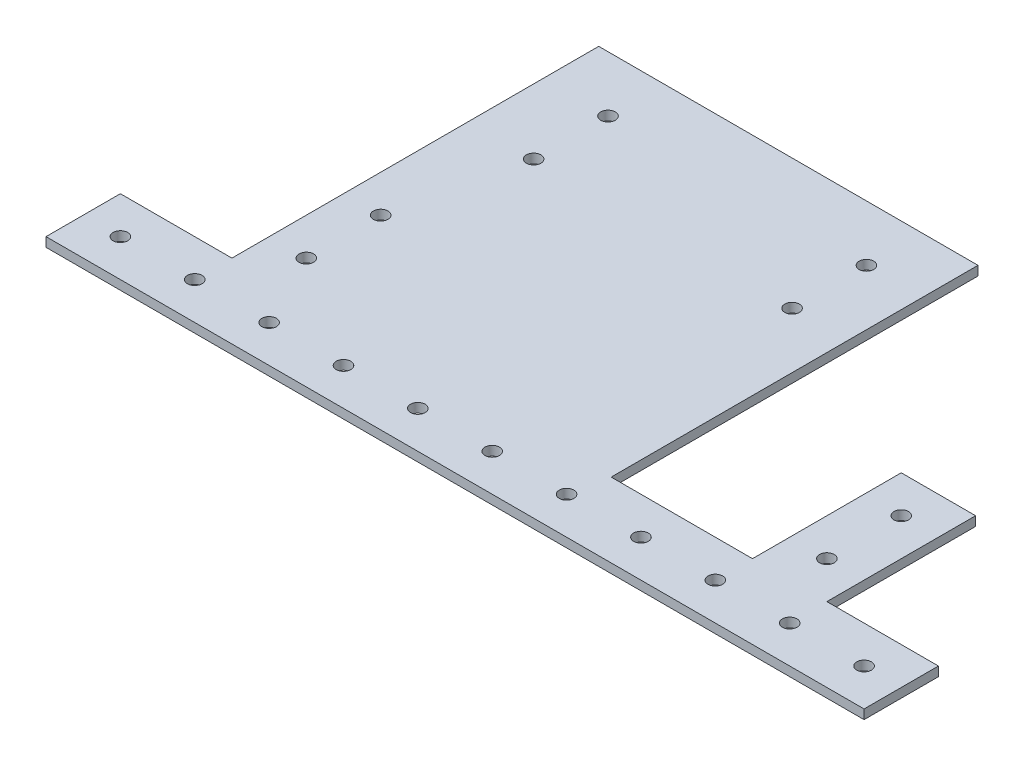
ISO-10303-21;
HEADER;
FILE_DESCRIPTION(('STEP AP214'),'2;1');
FILE_NAME('part.step','',(''),(''),'','','');
FILE_SCHEMA(('AUTOMOTIVE_DESIGN { 1 0 10303 214 1 1 1 1 }'));
ENDSEC;
DATA;
#1=APPLICATION_CONTEXT('core data for automotive mechanical design processes');
#2=APPLICATION_PROTOCOL_DEFINITION('international standard','automotive_design',2000,#1);
#3=PRODUCT_CONTEXT('',#1,'mechanical');
#4=PRODUCT('Part','Part','',(#3));
#5=PRODUCT_RELATED_PRODUCT_CATEGORY('part','',(#4));
#6=PRODUCT_DEFINITION_FORMATION('','',#4);
#7=PRODUCT_DEFINITION_CONTEXT('part definition',#1,'design');
#8=PRODUCT_DEFINITION('design','',#6,#7);
#9=PRODUCT_DEFINITION_SHAPE('','',#8);
#10=(LENGTH_UNIT() NAMED_UNIT(*) SI_UNIT(.MILLI.,.METRE.));
#11=(NAMED_UNIT(*) PLANE_ANGLE_UNIT() SI_UNIT($,.RADIAN.));
#12=(NAMED_UNIT(*) SI_UNIT($,.STERADIAN.) SOLID_ANGLE_UNIT());
#13=UNCERTAINTY_MEASURE_WITH_UNIT(LENGTH_MEASURE(1.E-05),#10,'distance_accuracy_value','');
#14=(GEOMETRIC_REPRESENTATION_CONTEXT(3) GLOBAL_UNCERTAINTY_ASSIGNED_CONTEXT((#13)) GLOBAL_UNIT_ASSIGNED_CONTEXT((#10,
#11,#12)) REPRESENTATION_CONTEXT('',''));
#15=CARTESIAN_POINT('',(0.,0.,0.));
#16=DIRECTION('',(0.,0.,1.));
#17=DIRECTION('',(1.,0.,0.));
#18=AXIS2_PLACEMENT_3D('',#15,#16,#17);
#19=CARTESIAN_POINT('',(0.,3.175,0.));
#20=DIRECTION('',(0.,-1.,0.));
#21=DIRECTION('',(0.,0.,-1.));
#22=AXIS2_PLACEMENT_3D('',#19,#20,#21);
#23=PLANE('',#22);
#24=DIRECTION('',(0.,0.,1.));
#25=VECTOR('',#24,1.);
#26=CARTESIAN_POINT('',(-101.6,3.175,-25.4));
#27=LINE('',#26,#25);
#28=CARTESIAN_POINT('',(-101.6,3.175,-150.6728));
#29=VERTEX_POINT('',#28);
#30=CARTESIAN_POINT('',(-101.6,3.175,-25.4));
#31=VERTEX_POINT('',#30);
#32=EDGE_CURVE('E178',#29,#31,#27,.T.);
#33=ORIENTED_EDGE('',*,*,#32,.T.);
#34=DIRECTION('',(-1.,0.,0.));
#35=VECTOR('',#34,1.);
#36=CARTESIAN_POINT('',(-139.7,3.175,-25.4));
#37=LINE('',#36,#35);
#38=CARTESIAN_POINT('',(-139.7,3.175,-25.4));
#39=VERTEX_POINT('',#38);
#40=EDGE_CURVE('E106',#31,#39,#37,.T.);
#41=ORIENTED_EDGE('',*,*,#40,.T.);
#42=DIRECTION('',(0.,0.,1.));
#43=VECTOR('',#42,1.);
#44=CARTESIAN_POINT('',(-139.7,3.175,0.));
#45=LINE('',#44,#43);
#46=CARTESIAN_POINT('',(-139.7,3.175,0.));
#47=VERTEX_POINT('',#46);
#48=EDGE_CURVE('E205',#39,#47,#45,.T.);
#49=ORIENTED_EDGE('',*,*,#48,.T.);
#50=DIRECTION('',(1.,0.,0.));
#51=VECTOR('',#50,1.);
#52=CARTESIAN_POINT('',(139.7,3.175,0.));
#53=LINE('',#52,#51);
#54=CARTESIAN_POINT('',(139.7,3.175,0.));
#55=VERTEX_POINT('',#54);
#56=EDGE_CURVE('E224',#47,#55,#53,.T.);
#57=ORIENTED_EDGE('',*,*,#56,.T.);
#58=DIRECTION('',(0.,0.,-1.));
#59=VECTOR('',#58,1.);
#60=CARTESIAN_POINT('',(139.7,3.175,0.));
#61=LINE('',#60,#59);
#62=CARTESIAN_POINT('',(139.7,3.175,-25.4000000000001));
#63=VERTEX_POINT('',#62);
#64=EDGE_CURVE('E221',#55,#63,#61,.T.);
#65=ORIENTED_EDGE('',*,*,#64,.T.);
#66=DIRECTION('',(-1.,0.,0.));
#67=VECTOR('',#66,1.);
#68=CARTESIAN_POINT('',(139.7,3.175,-25.4000000000001));
#69=LINE('',#68,#67);
#70=CARTESIAN_POINT('',(101.6,3.175,-25.4));
#71=VERTEX_POINT('',#70);
#72=EDGE_CURVE('E223',#63,#71,#69,.T.);
#73=ORIENTED_EDGE('',*,*,#72,.T.);
#74=DIRECTION('',(0.,0.,-1.));
#75=VECTOR('',#74,1.);
#76=CARTESIAN_POINT('',(101.6,3.175,-25.4));
#77=LINE('',#76,#75);
#78=CARTESIAN_POINT('',(101.6,3.175,-76.2));
#79=VERTEX_POINT('',#78);
#80=EDGE_CURVE('E226',#71,#79,#77,.T.);
#81=ORIENTED_EDGE('',*,*,#80,.T.);
#82=DIRECTION('',(-1.,0.,0.));
#83=VECTOR('',#82,1.);
#84=CARTESIAN_POINT('',(76.1999999999999,3.175,-76.2));
#85=LINE('',#84,#83);
#86=CARTESIAN_POINT('',(76.1999999999999,3.175,-76.2));
#87=VERTEX_POINT('',#86);
#88=EDGE_CURVE('E232',#79,#87,#85,.T.);
#89=ORIENTED_EDGE('',*,*,#88,.T.);
#90=DIRECTION('',(0.,0.,1.));
#91=VECTOR('',#90,1.);
#92=CARTESIAN_POINT('',(76.1999999999999,3.175,-25.4));
#93=LINE('',#92,#91);
#94=CARTESIAN_POINT('',(76.1999999999999,3.175,-25.4));
#95=VERTEX_POINT('',#94);
#96=EDGE_CURVE('E137',#87,#95,#93,.T.);
#97=ORIENTED_EDGE('',*,*,#96,.T.);
#98=DIRECTION('',(-1.,0.,0.));
#99=VECTOR('',#98,1.);
#100=CARTESIAN_POINT('',(27.9400000000001,3.175,-25.3999999999999));
#101=LINE('',#100,#99);
#102=CARTESIAN_POINT('',(27.9400000000001,3.175,-25.3999999999999));
#103=VERTEX_POINT('',#102);
#104=EDGE_CURVE('E131',#95,#103,#101,.T.);
#105=ORIENTED_EDGE('',*,*,#104,.T.);
#106=DIRECTION('',(0.,0.,-1.));
#107=VECTOR('',#106,1.);
#108=CARTESIAN_POINT('',(27.9399999999999,3.175,-150.6728));
#109=LINE('',#108,#107);
#110=CARTESIAN_POINT('',(27.9399999999999,3.175,-150.6728));
#111=VERTEX_POINT('',#110);
#112=EDGE_CURVE('E135',#103,#111,#109,.T.);
#113=ORIENTED_EDGE('',*,*,#112,.T.);
#114=DIRECTION('',(-1.,0.,0.));
#115=VECTOR('',#114,1.);
#116=CARTESIAN_POINT('',(-101.6,3.175,-150.6728));
#117=LINE('',#116,#115);
#118=EDGE_CURVE('E51',#111,#29,#117,.T.);
#119=ORIENTED_EDGE('',*,*,#118,.T.);
#120=EDGE_LOOP('',(#33,#41,#49,#57,#65,#73,#81,#89,#97,#105,#113,#119));
#121=FACE_BOUND('',#120,.T.);
#122=CARTESIAN_POINT('',(-127.,3.175,-12.7));
#123=DIRECTION('',(0.,1.,0.));
#124=DIRECTION('',(0.,0.,1.));
#125=AXIS2_PLACEMENT_3D('',#122,#123,#124);
#126=CIRCLE('',#125,2.4892);
#127=CARTESIAN_POINT('',(-127.,3.175,-10.2108));
#128=VERTEX_POINT('',#127);
#129=EDGE_CURVE('E159',#128,#128,#126,.T.);
#130=ORIENTED_EDGE('',*,*,#129,.F.);
#131=EDGE_LOOP('',(#130));
#132=FACE_BOUND('',#131,.T.);
#133=CARTESIAN_POINT('',(-88.8999999999999,3.175,-38.1));
#134=DIRECTION('',(0.,1.,0.));
#135=DIRECTION('',(0.,0.,1.));
#136=AXIS2_PLACEMENT_3D('',#133,#134,#135);
#137=CIRCLE('',#136,2.4892);
#138=CARTESIAN_POINT('',(-88.8999999999999,3.175,-35.6108));
#139=VERTEX_POINT('',#138);
#140=EDGE_CURVE('E446',#139,#139,#137,.T.);
#141=ORIENTED_EDGE('',*,*,#140,.F.);
#142=EDGE_LOOP('',(#141));
#143=FACE_BOUND('',#142,.T.);
#144=CARTESIAN_POINT('',(-88.8999999999999,3.175,-63.5));
#145=DIRECTION('',(0.,1.,0.));
#146=DIRECTION('',(0.,0.,1.));
#147=AXIS2_PLACEMENT_3D('',#144,#145,#146);
#148=CIRCLE('',#147,2.4892);
#149=CARTESIAN_POINT('',(-88.8999999999999,3.175,-61.0108));
#150=VERTEX_POINT('',#149);
#151=EDGE_CURVE('E440',#150,#150,#148,.T.);
#152=ORIENTED_EDGE('',*,*,#151,.F.);
#153=EDGE_LOOP('',(#152));
#154=FACE_BOUND('',#153,.T.);
#155=CARTESIAN_POINT('',(-79.375,3.175,-131.6228));
#156=DIRECTION('',(0.,1.,0.));
#157=DIRECTION('',(0.,0.,1.));
#158=AXIS2_PLACEMENT_3D('',#155,#156,#157);
#159=CIRCLE('',#158,2.48920000000002);
#160=CARTESIAN_POINT('',(-79.375,3.175,-129.1336));
#161=VERTEX_POINT('',#160);
#162=EDGE_CURVE('E434',#161,#161,#159,.T.);
#163=ORIENTED_EDGE('',*,*,#162,.F.);
#164=EDGE_LOOP('',(#163));
#165=FACE_BOUND('',#164,.T.);
#166=CARTESIAN_POINT('',(-79.375,3.175,-106.2228));
#167=DIRECTION('',(0.,1.,0.));
#168=DIRECTION('',(0.,0.,1.));
#169=AXIS2_PLACEMENT_3D('',#166,#167,#168);
#170=CIRCLE('',#169,2.4892);
#171=CARTESIAN_POINT('',(-79.375,3.175,-103.7336));
#172=VERTEX_POINT('',#171);
#173=EDGE_CURVE('E428',#172,#172,#170,.T.);
#174=ORIENTED_EDGE('',*,*,#173,.F.);
#175=EDGE_LOOP('',(#174));
#176=FACE_BOUND('',#175,.T.);
#177=CARTESIAN_POINT('',(8.88999999999996,3.175,-106.2228));
#178=DIRECTION('',(0.,1.,0.));
#179=DIRECTION('',(0.,0.,1.));
#180=AXIS2_PLACEMENT_3D('',#177,#178,#179);
#181=CIRCLE('',#180,2.48919999999999);
#182=CARTESIAN_POINT('',(8.88999999999996,3.175,-103.7336));
#183=VERTEX_POINT('',#182);
#184=EDGE_CURVE('E422',#183,#183,#181,.T.);
#185=ORIENTED_EDGE('',*,*,#184,.F.);
#186=EDGE_LOOP('',(#185));
#187=FACE_BOUND('',#186,.T.);
#188=CARTESIAN_POINT('',(8.88999999999995,3.175,-131.6228));
#189=DIRECTION('',(0.,1.,0.));
#190=DIRECTION('',(0.,0.,1.));
#191=AXIS2_PLACEMENT_3D('',#188,#189,#190);
#192=CIRCLE('',#191,2.48920000000002);
#193=CARTESIAN_POINT('',(8.88999999999995,3.175,-129.1336));
#194=VERTEX_POINT('',#193);
#195=EDGE_CURVE('E416',#194,#194,#192,.T.);
#196=ORIENTED_EDGE('',*,*,#195,.F.);
#197=EDGE_LOOP('',(#196));
#198=FACE_BOUND('',#197,.T.);
#199=CARTESIAN_POINT('',(88.8999999999999,3.175,-63.5));
#200=DIRECTION('',(0.,1.,0.));
#201=DIRECTION('',(0.,0.,1.));
#202=AXIS2_PLACEMENT_3D('',#199,#200,#201);
#203=CIRCLE('',#202,2.48920000000002);
#204=CARTESIAN_POINT('',(88.8999999999999,3.175,-61.0108));
#205=VERTEX_POINT('',#204);
#206=EDGE_CURVE('E410',#205,#205,#203,.T.);
#207=ORIENTED_EDGE('',*,*,#206,.F.);
#208=EDGE_LOOP('',(#207));
#209=FACE_BOUND('',#208,.T.);
#210=CARTESIAN_POINT('',(88.8999999999999,3.175,-38.1));
#211=DIRECTION('',(0.,1.,0.));
#212=DIRECTION('',(0.,0.,1.));
#213=AXIS2_PLACEMENT_3D('',#210,#211,#212);
#214=CIRCLE('',#213,2.4892);
#215=CARTESIAN_POINT('',(88.8999999999999,3.175,-35.6108));
#216=VERTEX_POINT('',#215);
#217=EDGE_CURVE('E404',#216,#216,#214,.T.);
#218=ORIENTED_EDGE('',*,*,#217,.F.);
#219=EDGE_LOOP('',(#218));
#220=FACE_BOUND('',#219,.T.);
#221=CARTESIAN_POINT('',(-101.6,3.175,-12.7));
#222=DIRECTION('',(0.,1.,0.));
#223=DIRECTION('',(0.,0.,1.));
#224=AXIS2_PLACEMENT_3D('',#221,#222,#223);
#225=CIRCLE('',#224,2.4892);
#226=CARTESIAN_POINT('',(-101.6,3.175,-10.2108));
#227=VERTEX_POINT('',#226);
#228=EDGE_CURVE('E398',#227,#227,#225,.T.);
#229=ORIENTED_EDGE('',*,*,#228,.F.);
#230=EDGE_LOOP('',(#229));
#231=FACE_BOUND('',#230,.T.);
#232=CARTESIAN_POINT('',(-76.2,3.175,-12.7));
#233=DIRECTION('',(0.,1.,0.));
#234=DIRECTION('',(0.,0.,1.));
#235=AXIS2_PLACEMENT_3D('',#232,#233,#234);
#236=CIRCLE('',#235,2.4892);
#237=CARTESIAN_POINT('',(-76.2,3.175,-10.2108));
#238=VERTEX_POINT('',#237);
#239=EDGE_CURVE('E392',#238,#238,#236,.T.);
#240=ORIENTED_EDGE('',*,*,#239,.F.);
#241=EDGE_LOOP('',(#240));
#242=FACE_BOUND('',#241,.T.);
#243=CARTESIAN_POINT('',(-50.8,3.175,-12.7));
#244=DIRECTION('',(0.,1.,0.));
#245=DIRECTION('',(0.,0.,1.));
#246=AXIS2_PLACEMENT_3D('',#243,#244,#245);
#247=CIRCLE('',#246,2.4892);
#248=CARTESIAN_POINT('',(-50.8,3.175,-10.2108));
#249=VERTEX_POINT('',#248);
#250=EDGE_CURVE('E386',#249,#249,#247,.T.);
#251=ORIENTED_EDGE('',*,*,#250,.F.);
#252=EDGE_LOOP('',(#251));
#253=FACE_BOUND('',#252,.T.);
#254=CARTESIAN_POINT('',(-25.4,3.175,-12.7));
#255=DIRECTION('',(0.,1.,0.));
#256=DIRECTION('',(0.,0.,1.));
#257=AXIS2_PLACEMENT_3D('',#254,#255,#256);
#258=CIRCLE('',#257,2.4892);
#259=CARTESIAN_POINT('',(-25.4,3.175,-10.2108));
#260=VERTEX_POINT('',#259);
#261=EDGE_CURVE('E380',#260,#260,#258,.T.);
#262=ORIENTED_EDGE('',*,*,#261,.F.);
#263=EDGE_LOOP('',(#262));
#264=FACE_BOUND('',#263,.T.);
#265=CARTESIAN_POINT('',(0.,3.175,-12.7));
#266=DIRECTION('',(0.,1.,0.));
#267=DIRECTION('',(0.,0.,1.));
#268=AXIS2_PLACEMENT_3D('',#265,#266,#267);
#269=CIRCLE('',#268,2.4892);
#270=CARTESIAN_POINT('',(0.,3.175,-10.2108));
#271=VERTEX_POINT('',#270);
#272=EDGE_CURVE('E374',#271,#271,#269,.T.);
#273=ORIENTED_EDGE('',*,*,#272,.F.);
#274=EDGE_LOOP('',(#273));
#275=FACE_BOUND('',#274,.T.);
#276=CARTESIAN_POINT('',(25.4,3.175,-12.7));
#277=DIRECTION('',(0.,1.,0.));
#278=DIRECTION('',(0.,0.,1.));
#279=AXIS2_PLACEMENT_3D('',#276,#277,#278);
#280=CIRCLE('',#279,2.4892);
#281=CARTESIAN_POINT('',(25.4,3.175,-10.2108));
#282=VERTEX_POINT('',#281);
#283=EDGE_CURVE('E368',#282,#282,#280,.T.);
#284=ORIENTED_EDGE('',*,*,#283,.F.);
#285=EDGE_LOOP('',(#284));
#286=FACE_BOUND('',#285,.T.);
#287=CARTESIAN_POINT('',(50.8,3.175,-12.7));
#288=DIRECTION('',(0.,1.,0.));
#289=DIRECTION('',(0.,0.,1.));
#290=AXIS2_PLACEMENT_3D('',#287,#288,#289);
#291=CIRCLE('',#290,2.4892);
#292=CARTESIAN_POINT('',(50.8,3.175,-10.2108));
#293=VERTEX_POINT('',#292);
#294=EDGE_CURVE('E362',#293,#293,#291,.T.);
#295=ORIENTED_EDGE('',*,*,#294,.F.);
#296=EDGE_LOOP('',(#295));
#297=FACE_BOUND('',#296,.T.);
#298=CARTESIAN_POINT('',(76.2,3.175,-12.7));
#299=DIRECTION('',(0.,1.,0.));
#300=DIRECTION('',(0.,0.,1.));
#301=AXIS2_PLACEMENT_3D('',#298,#299,#300);
#302=CIRCLE('',#301,2.4892);
#303=CARTESIAN_POINT('',(76.2,3.175,-10.2108));
#304=VERTEX_POINT('',#303);
#305=EDGE_CURVE('E356',#304,#304,#302,.T.);
#306=ORIENTED_EDGE('',*,*,#305,.F.);
#307=EDGE_LOOP('',(#306));
#308=FACE_BOUND('',#307,.T.);
#309=CARTESIAN_POINT('',(101.6,3.175,-12.7));
#310=DIRECTION('',(0.,1.,0.));
#311=DIRECTION('',(0.,0.,1.));
#312=AXIS2_PLACEMENT_3D('',#309,#310,#311);
#313=CIRCLE('',#312,2.4892);
#314=CARTESIAN_POINT('',(101.6,3.175,-10.2108));
#315=VERTEX_POINT('',#314);
#316=EDGE_CURVE('E350',#315,#315,#313,.T.);
#317=ORIENTED_EDGE('',*,*,#316,.F.);
#318=EDGE_LOOP('',(#317));
#319=FACE_BOUND('',#318,.T.);
#320=CARTESIAN_POINT('',(127.,3.175,-12.7));
#321=DIRECTION('',(0.,1.,0.));
#322=DIRECTION('',(0.,0.,1.));
#323=AXIS2_PLACEMENT_3D('',#320,#321,#322);
#324=CIRCLE('',#323,2.4892);
#325=CARTESIAN_POINT('',(127.,3.175,-10.2108));
#326=VERTEX_POINT('',#325);
#327=EDGE_CURVE('E341',#326,#326,#324,.T.);
#328=ORIENTED_EDGE('',*,*,#327,.F.);
#329=EDGE_LOOP('',(#328));
#330=FACE_BOUND('',#329,.T.);
#331=ADVANCED_FACE('F34',(#121,#132,#143,#154,#165,#176,#187,#198,#209,#220,#231,#242,#253,#264,
#275,#286,#297,#308,#319,#330),#23,.F.);
#332=CARTESIAN_POINT('',(0.,0.,0.));
#333=DIRECTION('',(0.,-1.,0.));
#334=DIRECTION('',(0.,0.,-1.));
#335=AXIS2_PLACEMENT_3D('',#332,#333,#334);
#336=PLANE('',#335);
#337=CARTESIAN_POINT('',(101.6,0.,-12.7));
#338=DIRECTION('',(0.,1.,0.));
#339=DIRECTION('',(0.,0.,1.));
#340=AXIS2_PLACEMENT_3D('',#337,#338,#339);
#341=CIRCLE('',#340,2.4892);
#342=CARTESIAN_POINT('',(101.6,0.,-10.2108));
#343=VERTEX_POINT('',#342);
#344=EDGE_CURVE('E347',#343,#343,#341,.T.);
#345=ORIENTED_EDGE('',*,*,#344,.T.);
#346=EDGE_LOOP('',(#345));
#347=FACE_BOUND('',#346,.T.);
#348=CARTESIAN_POINT('',(50.8,0.,-12.7));
#349=DIRECTION('',(0.,1.,0.));
#350=DIRECTION('',(0.,0.,1.));
#351=AXIS2_PLACEMENT_3D('',#348,#349,#350);
#352=CIRCLE('',#351,2.4892);
#353=CARTESIAN_POINT('',(50.8,0.,-10.2108));
#354=VERTEX_POINT('',#353);
#355=EDGE_CURVE('E359',#354,#354,#352,.T.);
#356=ORIENTED_EDGE('',*,*,#355,.T.);
#357=EDGE_LOOP('',(#356));
#358=FACE_BOUND('',#357,.T.);
#359=CARTESIAN_POINT('',(0.,0.,-12.7));
#360=DIRECTION('',(0.,1.,0.));
#361=DIRECTION('',(0.,0.,1.));
#362=AXIS2_PLACEMENT_3D('',#359,#360,#361);
#363=CIRCLE('',#362,2.4892);
#364=CARTESIAN_POINT('',(0.,0.,-10.2108));
#365=VERTEX_POINT('',#364);
#366=EDGE_CURVE('E371',#365,#365,#363,.T.);
#367=ORIENTED_EDGE('',*,*,#366,.T.);
#368=EDGE_LOOP('',(#367));
#369=FACE_BOUND('',#368,.T.);
#370=CARTESIAN_POINT('',(-50.8,0.,-12.7));
#371=DIRECTION('',(0.,1.,0.));
#372=DIRECTION('',(0.,0.,1.));
#373=AXIS2_PLACEMENT_3D('',#370,#371,#372);
#374=CIRCLE('',#373,2.4892);
#375=CARTESIAN_POINT('',(-50.8,0.,-10.2108));
#376=VERTEX_POINT('',#375);
#377=EDGE_CURVE('E383',#376,#376,#374,.T.);
#378=ORIENTED_EDGE('',*,*,#377,.T.);
#379=EDGE_LOOP('',(#378));
#380=FACE_BOUND('',#379,.T.);
#381=CARTESIAN_POINT('',(-101.6,0.,-12.7));
#382=DIRECTION('',(0.,1.,0.));
#383=DIRECTION('',(0.,0.,1.));
#384=AXIS2_PLACEMENT_3D('',#381,#382,#383);
#385=CIRCLE('',#384,2.4892);
#386=CARTESIAN_POINT('',(-101.6,0.,-10.2108));
#387=VERTEX_POINT('',#386);
#388=EDGE_CURVE('E395',#387,#387,#385,.T.);
#389=ORIENTED_EDGE('',*,*,#388,.T.);
#390=EDGE_LOOP('',(#389));
#391=FACE_BOUND('',#390,.T.);
#392=CARTESIAN_POINT('',(88.8999999999999,0.,-63.5));
#393=DIRECTION('',(0.,1.,0.));
#394=DIRECTION('',(0.,0.,1.));
#395=AXIS2_PLACEMENT_3D('',#392,#393,#394);
#396=CIRCLE('',#395,2.48920000000002);
#397=CARTESIAN_POINT('',(88.8999999999999,0.,-61.0108));
#398=VERTEX_POINT('',#397);
#399=EDGE_CURVE('E407',#398,#398,#396,.T.);
#400=ORIENTED_EDGE('',*,*,#399,.T.);
#401=EDGE_LOOP('',(#400));
#402=FACE_BOUND('',#401,.T.);
#403=CARTESIAN_POINT('',(8.88999999999996,0.,-106.2228));
#404=DIRECTION('',(0.,1.,0.));
#405=DIRECTION('',(0.,0.,1.));
#406=AXIS2_PLACEMENT_3D('',#403,#404,#405);
#407=CIRCLE('',#406,2.48919999999999);
#408=CARTESIAN_POINT('',(8.88999999999996,0.,-103.7336));
#409=VERTEX_POINT('',#408);
#410=EDGE_CURVE('E419',#409,#409,#407,.T.);
#411=ORIENTED_EDGE('',*,*,#410,.T.);
#412=EDGE_LOOP('',(#411));
#413=FACE_BOUND('',#412,.T.);
#414=CARTESIAN_POINT('',(-79.375,0.,-131.6228));
#415=DIRECTION('',(0.,1.,0.));
#416=DIRECTION('',(0.,0.,1.));
#417=AXIS2_PLACEMENT_3D('',#414,#415,#416);
#418=CIRCLE('',#417,2.48920000000002);
#419=CARTESIAN_POINT('',(-79.375,0.,-129.1336));
#420=VERTEX_POINT('',#419);
#421=EDGE_CURVE('E431',#420,#420,#418,.T.);
#422=ORIENTED_EDGE('',*,*,#421,.T.);
#423=EDGE_LOOP('',(#422));
#424=FACE_BOUND('',#423,.T.);
#425=CARTESIAN_POINT('',(-88.8999999999999,0.,-38.1));
#426=DIRECTION('',(0.,1.,0.));
#427=DIRECTION('',(0.,0.,1.));
#428=AXIS2_PLACEMENT_3D('',#425,#426,#427);
#429=CIRCLE('',#428,2.4892);
#430=CARTESIAN_POINT('',(-88.8999999999999,0.,-35.6108));
#431=VERTEX_POINT('',#430);
#432=EDGE_CURVE('E443',#431,#431,#429,.T.);
#433=ORIENTED_EDGE('',*,*,#432,.T.);
#434=EDGE_LOOP('',(#433));
#435=FACE_BOUND('',#434,.T.);
#436=DIRECTION('',(0.,0.,1.));
#437=VECTOR('',#436,1.);
#438=CARTESIAN_POINT('',(-101.6,0.,-25.4));
#439=LINE('',#438,#437);
#440=CARTESIAN_POINT('',(-101.6,0.,-150.6728));
#441=VERTEX_POINT('',#440);
#442=CARTESIAN_POINT('',(-101.6,0.,-25.4));
#443=VERTEX_POINT('',#442);
#444=EDGE_CURVE('E155',#441,#443,#439,.T.);
#445=ORIENTED_EDGE('',*,*,#444,.F.);
#446=DIRECTION('',(-1.,0.,0.));
#447=VECTOR('',#446,1.);
#448=CARTESIAN_POINT('',(-101.6,0.,-150.6728));
#449=LINE('',#448,#447);
#450=CARTESIAN_POINT('',(27.9399999999999,0.,-150.6728));
#451=VERTEX_POINT('',#450);
#452=EDGE_CURVE('E98',#451,#441,#449,.T.);
#453=ORIENTED_EDGE('',*,*,#452,.F.);
#454=DIRECTION('',(0.,0.,-1.));
#455=VECTOR('',#454,1.);
#456=CARTESIAN_POINT('',(27.9399999999999,0.,-150.6728));
#457=LINE('',#456,#455);
#458=CARTESIAN_POINT('',(27.9400000000001,0.,-25.3999999999999));
#459=VERTEX_POINT('',#458);
#460=EDGE_CURVE('E92',#459,#451,#457,.T.);
#461=ORIENTED_EDGE('',*,*,#460,.F.);
#462=DIRECTION('',(-1.,0.,0.));
#463=VECTOR('',#462,1.);
#464=CARTESIAN_POINT('',(27.9400000000001,0.,-25.3999999999999));
#465=LINE('',#464,#463);
#466=CARTESIAN_POINT('',(76.1999999999999,0.,-25.4));
#467=VERTEX_POINT('',#466);
#468=EDGE_CURVE('E145',#467,#459,#465,.T.);
#469=ORIENTED_EDGE('',*,*,#468,.F.);
#470=DIRECTION('',(0.,0.,1.));
#471=VECTOR('',#470,1.);
#472=CARTESIAN_POINT('',(76.1999999999999,0.,-25.4));
#473=LINE('',#472,#471);
#474=CARTESIAN_POINT('',(76.1999999999999,0.,-76.2));
#475=VERTEX_POINT('',#474);
#476=EDGE_CURVE('E173',#475,#467,#473,.T.);
#477=ORIENTED_EDGE('',*,*,#476,.F.);
#478=DIRECTION('',(-1.,0.,0.));
#479=VECTOR('',#478,1.);
#480=CARTESIAN_POINT('',(76.1999999999999,0.,-76.2));
#481=LINE('',#480,#479);
#482=CARTESIAN_POINT('',(101.6,0.,-76.2));
#483=VERTEX_POINT('',#482);
#484=EDGE_CURVE('E171',#483,#475,#481,.T.);
#485=ORIENTED_EDGE('',*,*,#484,.F.);
#486=DIRECTION('',(0.,0.,-1.));
#487=VECTOR('',#486,1.);
#488=CARTESIAN_POINT('',(101.6,0.,-25.4));
#489=LINE('',#488,#487);
#490=CARTESIAN_POINT('',(101.6,0.,-25.4));
#491=VERTEX_POINT('',#490);
#492=EDGE_CURVE('E169',#491,#483,#489,.T.);
#493=ORIENTED_EDGE('',*,*,#492,.F.);
#494=DIRECTION('',(-1.,0.,0.));
#495=VECTOR('',#494,1.);
#496=CARTESIAN_POINT('',(139.7,0.,-25.4000000000001));
#497=LINE('',#496,#495);
#498=CARTESIAN_POINT('',(139.7,0.,-25.4000000000001));
#499=VERTEX_POINT('',#498);
#500=EDGE_CURVE('E167',#499,#491,#497,.T.);
#501=ORIENTED_EDGE('',*,*,#500,.F.);
#502=DIRECTION('',(0.,0.,-1.));
#503=VECTOR('',#502,1.);
#504=CARTESIAN_POINT('',(139.7,0.,0.));
#505=LINE('',#504,#503);
#506=CARTESIAN_POINT('',(139.7,0.,0.));
#507=VERTEX_POINT('',#506);
#508=EDGE_CURVE('E165',#507,#499,#505,.T.);
#509=ORIENTED_EDGE('',*,*,#508,.F.);
#510=DIRECTION('',(1.,0.,0.));
#511=VECTOR('',#510,1.);
#512=CARTESIAN_POINT('',(139.7,0.,0.));
#513=LINE('',#512,#511);
#514=CARTESIAN_POINT('',(-139.7,0.,0.));
#515=VERTEX_POINT('',#514);
#516=EDGE_CURVE('E163',#515,#507,#513,.T.);
#517=ORIENTED_EDGE('',*,*,#516,.F.);
#518=DIRECTION('',(0.,0.,1.));
#519=VECTOR('',#518,1.);
#520=CARTESIAN_POINT('',(-139.7,0.,0.));
#521=LINE('',#520,#519);
#522=CARTESIAN_POINT('',(-139.7,0.,-25.4));
#523=VERTEX_POINT('',#522);
#524=EDGE_CURVE('E161',#523,#515,#521,.T.);
#525=ORIENTED_EDGE('',*,*,#524,.F.);
#526=DIRECTION('',(-1.,0.,0.));
#527=VECTOR('',#526,1.);
#528=CARTESIAN_POINT('',(-139.7,0.,-25.4));
#529=LINE('',#528,#527);
#530=EDGE_CURVE('E158',#443,#523,#529,.T.);
#531=ORIENTED_EDGE('',*,*,#530,.F.);
#532=EDGE_LOOP('',(#445,#453,#461,#469,#477,#485,#493,#501,#509,#517,#525,#531));
#533=FACE_BOUND('',#532,.T.);
#534=CARTESIAN_POINT('',(-127.,0.,-12.7));
#535=DIRECTION('',(0.,1.,0.));
#536=DIRECTION('',(0.,0.,1.));
#537=AXIS2_PLACEMENT_3D('',#534,#535,#536);
#538=CIRCLE('',#537,2.4892);
#539=CARTESIAN_POINT('',(-127.,0.,-10.2108));
#540=VERTEX_POINT('',#539);
#541=EDGE_CURVE('E449',#540,#540,#538,.T.);
#542=ORIENTED_EDGE('',*,*,#541,.T.);
#543=EDGE_LOOP('',(#542));
#544=FACE_BOUND('',#543,.T.);
#545=CARTESIAN_POINT('',(-88.8999999999999,0.,-63.5));
#546=DIRECTION('',(0.,1.,0.));
#547=DIRECTION('',(0.,0.,1.));
#548=AXIS2_PLACEMENT_3D('',#545,#546,#547);
#549=CIRCLE('',#548,2.4892);
#550=CARTESIAN_POINT('',(-88.8999999999999,0.,-61.0108));
#551=VERTEX_POINT('',#550);
#552=EDGE_CURVE('E437',#551,#551,#549,.T.);
#553=ORIENTED_EDGE('',*,*,#552,.T.);
#554=EDGE_LOOP('',(#553));
#555=FACE_BOUND('',#554,.T.);
#556=CARTESIAN_POINT('',(-79.375,0.,-106.2228));
#557=DIRECTION('',(0.,1.,0.));
#558=DIRECTION('',(0.,0.,1.));
#559=AXIS2_PLACEMENT_3D('',#556,#557,#558);
#560=CIRCLE('',#559,2.4892);
#561=CARTESIAN_POINT('',(-79.375,0.,-103.7336));
#562=VERTEX_POINT('',#561);
#563=EDGE_CURVE('E425',#562,#562,#560,.T.);
#564=ORIENTED_EDGE('',*,*,#563,.T.);
#565=EDGE_LOOP('',(#564));
#566=FACE_BOUND('',#565,.T.);
#567=CARTESIAN_POINT('',(8.88999999999995,0.,-131.6228));
#568=DIRECTION('',(0.,1.,0.));
#569=DIRECTION('',(0.,0.,1.));
#570=AXIS2_PLACEMENT_3D('',#567,#568,#569);
#571=CIRCLE('',#570,2.48920000000002);
#572=CARTESIAN_POINT('',(8.88999999999995,0.,-129.1336));
#573=VERTEX_POINT('',#572);
#574=EDGE_CURVE('E413',#573,#573,#571,.T.);
#575=ORIENTED_EDGE('',*,*,#574,.T.);
#576=EDGE_LOOP('',(#575));
#577=FACE_BOUND('',#576,.T.);
#578=CARTESIAN_POINT('',(88.8999999999999,0.,-38.1));
#579=DIRECTION('',(0.,1.,0.));
#580=DIRECTION('',(0.,0.,1.));
#581=AXIS2_PLACEMENT_3D('',#578,#579,#580);
#582=CIRCLE('',#581,2.4892);
#583=CARTESIAN_POINT('',(88.8999999999999,0.,-35.6108));
#584=VERTEX_POINT('',#583);
#585=EDGE_CURVE('E401',#584,#584,#582,.T.);
#586=ORIENTED_EDGE('',*,*,#585,.T.);
#587=EDGE_LOOP('',(#586));
#588=FACE_BOUND('',#587,.T.);
#589=CARTESIAN_POINT('',(-76.2,0.,-12.7));
#590=DIRECTION('',(0.,1.,0.));
#591=DIRECTION('',(0.,0.,1.));
#592=AXIS2_PLACEMENT_3D('',#589,#590,#591);
#593=CIRCLE('',#592,2.4892);
#594=CARTESIAN_POINT('',(-76.2,0.,-10.2108));
#595=VERTEX_POINT('',#594);
#596=EDGE_CURVE('E389',#595,#595,#593,.T.);
#597=ORIENTED_EDGE('',*,*,#596,.T.);
#598=EDGE_LOOP('',(#597));
#599=FACE_BOUND('',#598,.T.);
#600=CARTESIAN_POINT('',(-25.4,0.,-12.7));
#601=DIRECTION('',(0.,1.,0.));
#602=DIRECTION('',(0.,0.,1.));
#603=AXIS2_PLACEMENT_3D('',#600,#601,#602);
#604=CIRCLE('',#603,2.4892);
#605=CARTESIAN_POINT('',(-25.4,0.,-10.2108));
#606=VERTEX_POINT('',#605);
#607=EDGE_CURVE('E377',#606,#606,#604,.T.);
#608=ORIENTED_EDGE('',*,*,#607,.T.);
#609=EDGE_LOOP('',(#608));
#610=FACE_BOUND('',#609,.T.);
#611=CARTESIAN_POINT('',(25.4,0.,-12.7));
#612=DIRECTION('',(0.,1.,0.));
#613=DIRECTION('',(0.,0.,1.));
#614=AXIS2_PLACEMENT_3D('',#611,#612,#613);
#615=CIRCLE('',#614,2.4892);
#616=CARTESIAN_POINT('',(25.4,0.,-10.2108));
#617=VERTEX_POINT('',#616);
#618=EDGE_CURVE('E365',#617,#617,#615,.T.);
#619=ORIENTED_EDGE('',*,*,#618,.T.);
#620=EDGE_LOOP('',(#619));
#621=FACE_BOUND('',#620,.T.);
#622=CARTESIAN_POINT('',(76.2,0.,-12.7));
#623=DIRECTION('',(0.,1.,0.));
#624=DIRECTION('',(0.,0.,1.));
#625=AXIS2_PLACEMENT_3D('',#622,#623,#624);
#626=CIRCLE('',#625,2.4892);
#627=CARTESIAN_POINT('',(76.2,0.,-10.2108));
#628=VERTEX_POINT('',#627);
#629=EDGE_CURVE('E353',#628,#628,#626,.T.);
#630=ORIENTED_EDGE('',*,*,#629,.T.);
#631=EDGE_LOOP('',(#630));
#632=FACE_BOUND('',#631,.T.);
#633=CARTESIAN_POINT('',(127.,0.,-12.7));
#634=DIRECTION('',(0.,1.,0.));
#635=DIRECTION('',(0.,0.,1.));
#636=AXIS2_PLACEMENT_3D('',#633,#634,#635);
#637=CIRCLE('',#636,2.4892);
#638=CARTESIAN_POINT('',(127.,0.,-10.2108));
#639=VERTEX_POINT('',#638);
#640=EDGE_CURVE('E344',#639,#639,#637,.T.);
#641=ORIENTED_EDGE('',*,*,#640,.T.);
#642=EDGE_LOOP('',(#641));
#643=FACE_BOUND('',#642,.T.);
#644=ADVANCED_FACE('F209',(#347,#358,#369,#380,#391,#402,#413,#424,#435,#533,#544,#555,#566,
#577,#588,#599,#610,#621,#632,#643),#336,.T.);
#645=CARTESIAN_POINT('',(-101.6,3.175,-25.4));
#646=DIRECTION('',(1.,0.,0.));
#647=DIRECTION('',(0.,0.,-1.));
#648=AXIS2_PLACEMENT_3D('',#645,#646,#647);
#649=PLANE('',#648);
#650=ORIENTED_EDGE('',*,*,#444,.T.);
#651=DIRECTION('',(0.,-1.,0.));
#652=VECTOR('',#651,1.);
#653=CARTESIAN_POINT('',(-101.6,3.175,-25.4));
#654=LINE('',#653,#652);
#655=EDGE_CURVE('E11',#31,#443,#654,.T.);
#656=ORIENTED_EDGE('',*,*,#655,.F.);
#657=ORIENTED_EDGE('',*,*,#32,.F.);
#658=DIRECTION('',(0.,-1.,0.));
#659=VECTOR('',#658,1.);
#660=CARTESIAN_POINT('',(-101.6,3.175,-150.6728));
#661=LINE('',#660,#659);
#662=EDGE_CURVE('E151',#29,#441,#661,.T.);
#663=ORIENTED_EDGE('',*,*,#662,.T.);
#664=EDGE_LOOP('',(#650,#656,#657,#663));
#665=FACE_BOUND('',#664,.T.);
#666=ADVANCED_FACE('F36',(#665),#649,.F.);
#667=CARTESIAN_POINT('',(-139.7,3.175,-25.4));
#668=DIRECTION('',(0.,0.,1.));
#669=DIRECTION('',(1.,0.,0.));
#670=AXIS2_PLACEMENT_3D('',#667,#668,#669);
#671=PLANE('',#670);
#672=ORIENTED_EDGE('',*,*,#530,.T.);
#673=DIRECTION('',(0.,-1.,0.));
#674=VECTOR('',#673,1.);
#675=CARTESIAN_POINT('',(-139.7,3.175,-25.4));
#676=LINE('',#675,#674);
#677=EDGE_CURVE('E43',#39,#523,#676,.T.);
#678=ORIENTED_EDGE('',*,*,#677,.F.);
#679=ORIENTED_EDGE('',*,*,#40,.F.);
#680=ORIENTED_EDGE('',*,*,#655,.T.);
#681=EDGE_LOOP('',(#672,#678,#679,#680));
#682=FACE_BOUND('',#681,.T.);
#683=ADVANCED_FACE('F696',(#682),#671,.F.);
#684=CARTESIAN_POINT('',(-139.7,3.175,0.));
#685=DIRECTION('',(1.,0.,0.));
#686=DIRECTION('',(0.,0.,-1.));
#687=AXIS2_PLACEMENT_3D('',#684,#685,#686);
#688=PLANE('',#687);
#689=ORIENTED_EDGE('',*,*,#524,.T.);
#690=DIRECTION('',(0.,-1.,0.));
#691=VECTOR('',#690,1.);
#692=CARTESIAN_POINT('',(-139.7,3.175,0.));
#693=LINE('',#692,#691);
#694=EDGE_CURVE('E197',#47,#515,#693,.T.);
#695=ORIENTED_EDGE('',*,*,#694,.F.);
#696=ORIENTED_EDGE('',*,*,#48,.F.);
#697=ORIENTED_EDGE('',*,*,#677,.T.);
#698=EDGE_LOOP('',(#689,#695,#696,#697));
#699=FACE_BOUND('',#698,.T.);
#700=ADVANCED_FACE('F203',(#699),#688,.F.);
#701=CARTESIAN_POINT('',(139.7,3.175,0.));
#702=DIRECTION('',(0.,0.,-1.));
#703=DIRECTION('',(-1.,0.,0.));
#704=AXIS2_PLACEMENT_3D('',#701,#702,#703);
#705=PLANE('',#704);
#706=ORIENTED_EDGE('',*,*,#516,.T.);
#707=DIRECTION('',(0.,-1.,0.));
#708=VECTOR('',#707,1.);
#709=CARTESIAN_POINT('',(139.7,3.175,0.));
#710=LINE('',#709,#708);
#711=EDGE_CURVE('E194',#55,#507,#710,.T.);
#712=ORIENTED_EDGE('',*,*,#711,.F.);
#713=ORIENTED_EDGE('',*,*,#56,.F.);
#714=ORIENTED_EDGE('',*,*,#694,.T.);
#715=EDGE_LOOP('',(#706,#712,#713,#714));
#716=FACE_BOUND('',#715,.T.);
#717=ADVANCED_FACE('F215',(#716),#705,.F.);
#718=CARTESIAN_POINT('',(139.7,3.175,0.));
#719=DIRECTION('',(-1.,0.,0.));
#720=DIRECTION('',(0.,0.,1.));
#721=AXIS2_PLACEMENT_3D('',#718,#719,#720);
#722=PLANE('',#721);
#723=ORIENTED_EDGE('',*,*,#508,.T.);
#724=DIRECTION('',(0.,-1.,0.));
#725=VECTOR('',#724,1.);
#726=CARTESIAN_POINT('',(139.7,3.175,-25.4000000000001));
#727=LINE('',#726,#725);
#728=EDGE_CURVE('E191',#63,#499,#727,.T.);
#729=ORIENTED_EDGE('',*,*,#728,.F.);
#730=ORIENTED_EDGE('',*,*,#64,.F.);
#731=ORIENTED_EDGE('',*,*,#711,.T.);
#732=EDGE_LOOP('',(#723,#729,#730,#731));
#733=FACE_BOUND('',#732,.T.);
#734=ADVANCED_FACE('F219',(#733),#722,.F.);
#735=CARTESIAN_POINT('',(139.7,3.175,-25.4000000000001));
#736=DIRECTION('',(0.,0.,1.));
#737=DIRECTION('',(1.,0.,0.));
#738=AXIS2_PLACEMENT_3D('',#735,#736,#737);
#739=PLANE('',#738);
#740=ORIENTED_EDGE('',*,*,#500,.T.);
#741=DIRECTION('',(0.,-1.,0.));
#742=VECTOR('',#741,1.);
#743=CARTESIAN_POINT('',(101.6,3.175,-25.4));
#744=LINE('',#743,#742);
#745=EDGE_CURVE('E188',#71,#491,#744,.T.);
#746=ORIENTED_EDGE('',*,*,#745,.F.);
#747=ORIENTED_EDGE('',*,*,#72,.F.);
#748=ORIENTED_EDGE('',*,*,#728,.T.);
#749=EDGE_LOOP('',(#740,#746,#747,#748));
#750=FACE_BOUND('',#749,.T.);
#751=ADVANCED_FACE('F661',(#750),#739,.F.);
#752=CARTESIAN_POINT('',(101.6,3.175,-25.4));
#753=DIRECTION('',(-1.,0.,0.));
#754=DIRECTION('',(0.,0.,1.));
#755=AXIS2_PLACEMENT_3D('',#752,#753,#754);
#756=PLANE('',#755);
#757=ORIENTED_EDGE('',*,*,#492,.T.);
#758=DIRECTION('',(0.,-1.,0.));
#759=VECTOR('',#758,1.);
#760=CARTESIAN_POINT('',(101.6,3.175,-76.2));
#761=LINE('',#760,#759);
#762=EDGE_CURVE('E185',#79,#483,#761,.T.);
#763=ORIENTED_EDGE('',*,*,#762,.F.);
#764=ORIENTED_EDGE('',*,*,#80,.F.);
#765=ORIENTED_EDGE('',*,*,#745,.T.);
#766=EDGE_LOOP('',(#757,#763,#764,#765));
#767=FACE_BOUND('',#766,.T.);
#768=ADVANCED_FACE('F652',(#767),#756,.F.);
#769=CARTESIAN_POINT('',(76.1999999999999,3.175,-76.2));
#770=DIRECTION('',(0.,0.,1.));
#771=DIRECTION('',(1.,0.,0.));
#772=AXIS2_PLACEMENT_3D('',#769,#770,#771);
#773=PLANE('',#772);
#774=ORIENTED_EDGE('',*,*,#484,.T.);
#775=DIRECTION('',(0.,-1.,0.));
#776=VECTOR('',#775,1.);
#777=CARTESIAN_POINT('',(76.1999999999999,3.175,-76.2));
#778=LINE('',#777,#776);
#779=EDGE_CURVE('E182',#87,#475,#778,.T.);
#780=ORIENTED_EDGE('',*,*,#779,.F.);
#781=ORIENTED_EDGE('',*,*,#88,.F.);
#782=ORIENTED_EDGE('',*,*,#762,.T.);
#783=EDGE_LOOP('',(#774,#780,#781,#782));
#784=FACE_BOUND('',#783,.T.);
#785=ADVANCED_FACE('F238',(#784),#773,.F.);
#786=CARTESIAN_POINT('',(76.1999999999999,3.175,-25.4));
#787=DIRECTION('',(1.,0.,0.));
#788=DIRECTION('',(0.,0.,-1.));
#789=AXIS2_PLACEMENT_3D('',#786,#787,#788);
#790=PLANE('',#789);
#791=ORIENTED_EDGE('',*,*,#476,.T.);
#792=DIRECTION('',(0.,-1.,0.));
#793=VECTOR('',#792,1.);
#794=CARTESIAN_POINT('',(76.1999999999999,3.175,-25.4));
#795=LINE('',#794,#793);
#796=EDGE_CURVE('E146',#95,#467,#795,.T.);
#797=ORIENTED_EDGE('',*,*,#796,.F.);
#798=ORIENTED_EDGE('',*,*,#96,.F.);
#799=ORIENTED_EDGE('',*,*,#779,.T.);
#800=EDGE_LOOP('',(#791,#797,#798,#799));
#801=FACE_BOUND('',#800,.T.);
#802=ADVANCED_FACE('F242',(#801),#790,.F.);
#803=CARTESIAN_POINT('',(27.9400000000001,3.175,-25.3999999999999));
#804=DIRECTION('',(0.,0.,1.));
#805=DIRECTION('',(1.,0.,0.));
#806=AXIS2_PLACEMENT_3D('',#803,#804,#805);
#807=PLANE('',#806);
#808=ORIENTED_EDGE('',*,*,#468,.T.);
#809=DIRECTION('',(0.,-1.,0.));
#810=VECTOR('',#809,1.);
#811=CARTESIAN_POINT('',(27.9400000000001,3.175,-25.3999999999999));
#812=LINE('',#811,#810);
#813=EDGE_CURVE('E142',#103,#459,#812,.T.);
#814=ORIENTED_EDGE('',*,*,#813,.F.);
#815=ORIENTED_EDGE('',*,*,#104,.F.);
#816=ORIENTED_EDGE('',*,*,#796,.T.);
#817=EDGE_LOOP('',(#808,#814,#815,#816));
#818=FACE_BOUND('',#817,.T.);
#819=ADVANCED_FACE('F143',(#818),#807,.F.);
#820=CARTESIAN_POINT('',(27.9399999999999,3.175,-150.6728));
#821=DIRECTION('',(-1.,0.,0.));
#822=DIRECTION('',(0.,0.,1.));
#823=AXIS2_PLACEMENT_3D('',#820,#821,#822);
#824=PLANE('',#823);
#825=ORIENTED_EDGE('',*,*,#460,.T.);
#826=DIRECTION('',(0.,-1.,0.));
#827=VECTOR('',#826,1.);
#828=CARTESIAN_POINT('',(27.9399999999999,3.175,-150.6728));
#829=LINE('',#828,#827);
#830=EDGE_CURVE('E147',#111,#451,#829,.T.);
#831=ORIENTED_EDGE('',*,*,#830,.F.);
#832=ORIENTED_EDGE('',*,*,#112,.F.);
#833=ORIENTED_EDGE('',*,*,#813,.T.);
#834=EDGE_LOOP('',(#825,#831,#832,#833));
#835=FACE_BOUND('',#834,.T.);
#836=ADVANCED_FACE('F149',(#835),#824,.F.);
#837=CARTESIAN_POINT('',(-101.6,3.175,-150.6728));
#838=DIRECTION('',(0.,0.,1.));
#839=DIRECTION('',(1.,0.,0.));
#840=AXIS2_PLACEMENT_3D('',#837,#838,#839);
#841=PLANE('',#840);
#842=ORIENTED_EDGE('',*,*,#452,.T.);
#843=ORIENTED_EDGE('',*,*,#662,.F.);
#844=ORIENTED_EDGE('',*,*,#118,.F.);
#845=ORIENTED_EDGE('',*,*,#830,.T.);
#846=EDGE_LOOP('',(#842,#843,#844,#845));
#847=FACE_BOUND('',#846,.T.);
#848=ADVANCED_FACE('F246',(#847),#841,.F.);
#849=CARTESIAN_POINT('',(-127.,3.175,-12.7));
#850=DIRECTION('',(0.,-1.,0.));
#851=DIRECTION('',(0.,0.,-1.));
#852=AXIS2_PLACEMENT_3D('',#849,#850,#851);
#853=CYLINDRICAL_SURFACE('',#852,2.4892);
#854=ORIENTED_EDGE('',*,*,#129,.T.);
#855=EDGE_LOOP('',(#854));
#856=FACE_BOUND('',#855,.T.);
#857=ORIENTED_EDGE('',*,*,#541,.F.);
#858=EDGE_LOOP('',(#857));
#859=FACE_BOUND('',#858,.T.);
#860=ADVANCED_FACE('F248',(#856,#859),#853,.F.);
#861=CARTESIAN_POINT('',(-88.8999999999999,3.175,-38.1));
#862=DIRECTION('',(0.,-1.,0.));
#863=DIRECTION('',(0.,0.,-1.));
#864=AXIS2_PLACEMENT_3D('',#861,#862,#863);
#865=CYLINDRICAL_SURFACE('',#864,2.4892);
#866=ORIENTED_EDGE('',*,*,#140,.T.);
#867=EDGE_LOOP('',(#866));
#868=FACE_BOUND('',#867,.T.);
#869=ORIENTED_EDGE('',*,*,#432,.F.);
#870=EDGE_LOOP('',(#869));
#871=FACE_BOUND('',#870,.T.);
#872=ADVANCED_FACE('F254',(#868,#871),#865,.F.);
#873=CARTESIAN_POINT('',(-88.8999999999999,3.175,-63.5));
#874=DIRECTION('',(0.,-1.,0.));
#875=DIRECTION('',(0.,0.,-1.));
#876=AXIS2_PLACEMENT_3D('',#873,#874,#875);
#877=CYLINDRICAL_SURFACE('',#876,2.4892);
#878=ORIENTED_EDGE('',*,*,#151,.T.);
#879=EDGE_LOOP('',(#878));
#880=FACE_BOUND('',#879,.T.);
#881=ORIENTED_EDGE('',*,*,#552,.F.);
#882=EDGE_LOOP('',(#881));
#883=FACE_BOUND('',#882,.T.);
#884=ADVANCED_FACE('F268',(#880,#883),#877,.F.);
#885=CARTESIAN_POINT('',(-79.375,3.175,-131.6228));
#886=DIRECTION('',(0.,-1.,0.));
#887=DIRECTION('',(0.,0.,-1.));
#888=AXIS2_PLACEMENT_3D('',#885,#886,#887);
#889=CYLINDRICAL_SURFACE('',#888,2.48920000000002);
#890=ORIENTED_EDGE('',*,*,#162,.T.);
#891=EDGE_LOOP('',(#890));
#892=FACE_BOUND('',#891,.T.);
#893=ORIENTED_EDGE('',*,*,#421,.F.);
#894=EDGE_LOOP('',(#893));
#895=FACE_BOUND('',#894,.T.);
#896=ADVANCED_FACE('F272',(#892,#895),#889,.F.);
#897=CARTESIAN_POINT('',(-79.375,3.175,-106.2228));
#898=DIRECTION('',(0.,-1.,0.));
#899=DIRECTION('',(0.,0.,-1.));
#900=AXIS2_PLACEMENT_3D('',#897,#898,#899);
#901=CYLINDRICAL_SURFACE('',#900,2.4892);
#902=ORIENTED_EDGE('',*,*,#173,.T.);
#903=EDGE_LOOP('',(#902));
#904=FACE_BOUND('',#903,.T.);
#905=ORIENTED_EDGE('',*,*,#563,.F.);
#906=EDGE_LOOP('',(#905));
#907=FACE_BOUND('',#906,.T.);
#908=ADVANCED_FACE('F276',(#904,#907),#901,.F.);
#909=CARTESIAN_POINT('',(8.88999999999996,3.175,-106.2228));
#910=DIRECTION('',(0.,-1.,0.));
#911=DIRECTION('',(0.,0.,-1.));
#912=AXIS2_PLACEMENT_3D('',#909,#910,#911);
#913=CYLINDRICAL_SURFACE('',#912,2.48919999999999);
#914=ORIENTED_EDGE('',*,*,#184,.T.);
#915=EDGE_LOOP('',(#914));
#916=FACE_BOUND('',#915,.T.);
#917=ORIENTED_EDGE('',*,*,#410,.F.);
#918=EDGE_LOOP('',(#917));
#919=FACE_BOUND('',#918,.T.);
#920=ADVANCED_FACE('F280',(#916,#919),#913,.F.);
#921=CARTESIAN_POINT('',(8.88999999999995,3.175,-131.6228));
#922=DIRECTION('',(0.,-1.,0.));
#923=DIRECTION('',(0.,0.,-1.));
#924=AXIS2_PLACEMENT_3D('',#921,#922,#923);
#925=CYLINDRICAL_SURFACE('',#924,2.48920000000002);
#926=ORIENTED_EDGE('',*,*,#195,.T.);
#927=EDGE_LOOP('',(#926));
#928=FACE_BOUND('',#927,.T.);
#929=ORIENTED_EDGE('',*,*,#574,.F.);
#930=EDGE_LOOP('',(#929));
#931=FACE_BOUND('',#930,.T.);
#932=ADVANCED_FACE('F284',(#928,#931),#925,.F.);
#933=CARTESIAN_POINT('',(88.8999999999999,3.175,-63.5));
#934=DIRECTION('',(0.,-1.,0.));
#935=DIRECTION('',(0.,0.,-1.));
#936=AXIS2_PLACEMENT_3D('',#933,#934,#935);
#937=CYLINDRICAL_SURFACE('',#936,2.48920000000002);
#938=ORIENTED_EDGE('',*,*,#206,.T.);
#939=EDGE_LOOP('',(#938));
#940=FACE_BOUND('',#939,.T.);
#941=ORIENTED_EDGE('',*,*,#399,.F.);
#942=EDGE_LOOP('',(#941));
#943=FACE_BOUND('',#942,.T.);
#944=ADVANCED_FACE('F288',(#940,#943),#937,.F.);
#945=CARTESIAN_POINT('',(88.8999999999999,3.175,-38.1));
#946=DIRECTION('',(0.,-1.,0.));
#947=DIRECTION('',(0.,0.,-1.));
#948=AXIS2_PLACEMENT_3D('',#945,#946,#947);
#949=CYLINDRICAL_SURFACE('',#948,2.4892);
#950=ORIENTED_EDGE('',*,*,#217,.T.);
#951=EDGE_LOOP('',(#950));
#952=FACE_BOUND('',#951,.T.);
#953=ORIENTED_EDGE('',*,*,#585,.F.);
#954=EDGE_LOOP('',(#953));
#955=FACE_BOUND('',#954,.T.);
#956=ADVANCED_FACE('F292',(#952,#955),#949,.F.);
#957=CARTESIAN_POINT('',(-101.6,3.175,-12.7));
#958=DIRECTION('',(0.,-1.,0.));
#959=DIRECTION('',(0.,0.,-1.));
#960=AXIS2_PLACEMENT_3D('',#957,#958,#959);
#961=CYLINDRICAL_SURFACE('',#960,2.4892);
#962=ORIENTED_EDGE('',*,*,#228,.T.);
#963=EDGE_LOOP('',(#962));
#964=FACE_BOUND('',#963,.T.);
#965=ORIENTED_EDGE('',*,*,#388,.F.);
#966=EDGE_LOOP('',(#965));
#967=FACE_BOUND('',#966,.T.);
#968=ADVANCED_FACE('F296',(#964,#967),#961,.F.);
#969=CARTESIAN_POINT('',(-76.2,3.175,-12.7));
#970=DIRECTION('',(0.,-1.,0.));
#971=DIRECTION('',(0.,0.,-1.));
#972=AXIS2_PLACEMENT_3D('',#969,#970,#971);
#973=CYLINDRICAL_SURFACE('',#972,2.4892);
#974=ORIENTED_EDGE('',*,*,#239,.T.);
#975=EDGE_LOOP('',(#974));
#976=FACE_BOUND('',#975,.T.);
#977=ORIENTED_EDGE('',*,*,#596,.F.);
#978=EDGE_LOOP('',(#977));
#979=FACE_BOUND('',#978,.T.);
#980=ADVANCED_FACE('F300',(#976,#979),#973,.F.);
#981=CARTESIAN_POINT('',(-50.8,3.175,-12.7));
#982=DIRECTION('',(0.,-1.,0.));
#983=DIRECTION('',(0.,0.,-1.));
#984=AXIS2_PLACEMENT_3D('',#981,#982,#983);
#985=CYLINDRICAL_SURFACE('',#984,2.4892);
#986=ORIENTED_EDGE('',*,*,#250,.T.);
#987=EDGE_LOOP('',(#986));
#988=FACE_BOUND('',#987,.T.);
#989=ORIENTED_EDGE('',*,*,#377,.F.);
#990=EDGE_LOOP('',(#989));
#991=FACE_BOUND('',#990,.T.);
#992=ADVANCED_FACE('F304',(#988,#991),#985,.F.);
#993=CARTESIAN_POINT('',(-25.4,3.175,-12.7));
#994=DIRECTION('',(0.,-1.,0.));
#995=DIRECTION('',(0.,0.,-1.));
#996=AXIS2_PLACEMENT_3D('',#993,#994,#995);
#997=CYLINDRICAL_SURFACE('',#996,2.4892);
#998=ORIENTED_EDGE('',*,*,#261,.T.);
#999=EDGE_LOOP('',(#998));
#1000=FACE_BOUND('',#999,.T.);
#1001=ORIENTED_EDGE('',*,*,#607,.F.);
#1002=EDGE_LOOP('',(#1001));
#1003=FACE_BOUND('',#1002,.T.);
#1004=ADVANCED_FACE('F308',(#1000,#1003),#997,.F.);
#1005=CARTESIAN_POINT('',(0.,3.175,-12.7));
#1006=DIRECTION('',(0.,-1.,0.));
#1007=DIRECTION('',(0.,0.,-1.));
#1008=AXIS2_PLACEMENT_3D('',#1005,#1006,#1007);
#1009=CYLINDRICAL_SURFACE('',#1008,2.4892);
#1010=ORIENTED_EDGE('',*,*,#272,.T.);
#1011=EDGE_LOOP('',(#1010));
#1012=FACE_BOUND('',#1011,.T.);
#1013=ORIENTED_EDGE('',*,*,#366,.F.);
#1014=EDGE_LOOP('',(#1013));
#1015=FACE_BOUND('',#1014,.T.);
#1016=ADVANCED_FACE('F312',(#1012,#1015),#1009,.F.);
#1017=CARTESIAN_POINT('',(25.4,3.175,-12.7));
#1018=DIRECTION('',(0.,-1.,0.));
#1019=DIRECTION('',(0.,0.,-1.));
#1020=AXIS2_PLACEMENT_3D('',#1017,#1018,#1019);
#1021=CYLINDRICAL_SURFACE('',#1020,2.4892);
#1022=ORIENTED_EDGE('',*,*,#283,.T.);
#1023=EDGE_LOOP('',(#1022));
#1024=FACE_BOUND('',#1023,.T.);
#1025=ORIENTED_EDGE('',*,*,#618,.F.);
#1026=EDGE_LOOP('',(#1025));
#1027=FACE_BOUND('',#1026,.T.);
#1028=ADVANCED_FACE('F316',(#1024,#1027),#1021,.F.);
#1029=CARTESIAN_POINT('',(50.8,3.175,-12.7));
#1030=DIRECTION('',(0.,-1.,0.));
#1031=DIRECTION('',(0.,0.,-1.));
#1032=AXIS2_PLACEMENT_3D('',#1029,#1030,#1031);
#1033=CYLINDRICAL_SURFACE('',#1032,2.4892);
#1034=ORIENTED_EDGE('',*,*,#294,.T.);
#1035=EDGE_LOOP('',(#1034));
#1036=FACE_BOUND('',#1035,.T.);
#1037=ORIENTED_EDGE('',*,*,#355,.F.);
#1038=EDGE_LOOP('',(#1037));
#1039=FACE_BOUND('',#1038,.T.);
#1040=ADVANCED_FACE('F320',(#1036,#1039),#1033,.F.);
#1041=CARTESIAN_POINT('',(76.2,3.175,-12.7));
#1042=DIRECTION('',(0.,-1.,0.));
#1043=DIRECTION('',(0.,0.,-1.));
#1044=AXIS2_PLACEMENT_3D('',#1041,#1042,#1043);
#1045=CYLINDRICAL_SURFACE('',#1044,2.4892);
#1046=ORIENTED_EDGE('',*,*,#305,.T.);
#1047=EDGE_LOOP('',(#1046));
#1048=FACE_BOUND('',#1047,.T.);
#1049=ORIENTED_EDGE('',*,*,#629,.F.);
#1050=EDGE_LOOP('',(#1049));
#1051=FACE_BOUND('',#1050,.T.);
#1052=ADVANCED_FACE('F324',(#1048,#1051),#1045,.F.);
#1053=CARTESIAN_POINT('',(101.6,3.175,-12.7));
#1054=DIRECTION('',(0.,-1.,0.));
#1055=DIRECTION('',(0.,0.,-1.));
#1056=AXIS2_PLACEMENT_3D('',#1053,#1054,#1055);
#1057=CYLINDRICAL_SURFACE('',#1056,2.4892);
#1058=ORIENTED_EDGE('',*,*,#316,.T.);
#1059=EDGE_LOOP('',(#1058));
#1060=FACE_BOUND('',#1059,.T.);
#1061=ORIENTED_EDGE('',*,*,#344,.F.);
#1062=EDGE_LOOP('',(#1061));
#1063=FACE_BOUND('',#1062,.T.);
#1064=ADVANCED_FACE('F328',(#1060,#1063),#1057,.F.);
#1065=CARTESIAN_POINT('',(127.,3.175,-12.7));
#1066=DIRECTION('',(0.,-1.,0.));
#1067=DIRECTION('',(0.,0.,-1.));
#1068=AXIS2_PLACEMENT_3D('',#1065,#1066,#1067);
#1069=CYLINDRICAL_SURFACE('',#1068,2.4892);
#1070=ORIENTED_EDGE('',*,*,#327,.T.);
#1071=EDGE_LOOP('',(#1070));
#1072=FACE_BOUND('',#1071,.T.);
#1073=ORIENTED_EDGE('',*,*,#640,.F.);
#1074=EDGE_LOOP('',(#1073));
#1075=FACE_BOUND('',#1074,.T.);
#1076=ADVANCED_FACE('F332',(#1072,#1075),#1069,.F.);
#1077=CLOSED_SHELL('',(#331,#644,#666,#683,#700,#717,#734,#751,#768,#785,#802,#819,#836,#848,
#860,#872,#884,#896,#908,#920,#932,#944,#956,#968,#980,#992,#1004,#1016,#1028,#1040,#1052,#1064,#1076));
#1078=MANIFOLD_SOLID_BREP('B2',#1077);
#1079=ADVANCED_BREP_SHAPE_REPRESENTATION('',(#18,#1078),#14);
#1080=SHAPE_DEFINITION_REPRESENTATION(#9,#1079);
ENDSEC;
END-ISO-10303-21;
